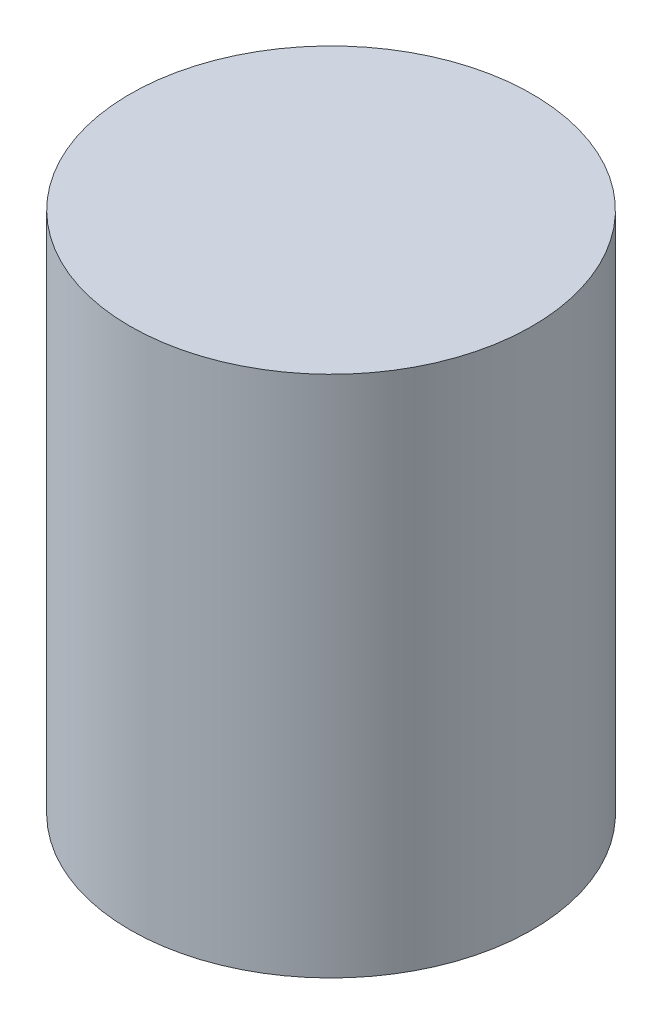
ISO-10303-21;
HEADER;
FILE_DESCRIPTION(('STEP AP214'),'2;1');
FILE_NAME('part.step','',(''),(''),'','','');
FILE_SCHEMA(('AUTOMOTIVE_DESIGN { 1 0 10303 214 1 1 1 1 }'));
ENDSEC;
DATA;
#1=APPLICATION_CONTEXT('core data for automotive mechanical design processes');
#2=APPLICATION_PROTOCOL_DEFINITION('international standard','automotive_design',2000,#1);
#3=PRODUCT_CONTEXT('',#1,'mechanical');
#4=PRODUCT('Part','Part','',(#3));
#5=PRODUCT_RELATED_PRODUCT_CATEGORY('part','',(#4));
#6=PRODUCT_DEFINITION_FORMATION('','',#4);
#7=PRODUCT_DEFINITION_CONTEXT('part definition',#1,'design');
#8=PRODUCT_DEFINITION('design','',#6,#7);
#9=PRODUCT_DEFINITION_SHAPE('','',#8);
#10=(LENGTH_UNIT() NAMED_UNIT(*) SI_UNIT(.MILLI.,.METRE.));
#11=(NAMED_UNIT(*) PLANE_ANGLE_UNIT() SI_UNIT($,.RADIAN.));
#12=(NAMED_UNIT(*) SI_UNIT($,.STERADIAN.) SOLID_ANGLE_UNIT());
#13=UNCERTAINTY_MEASURE_WITH_UNIT(LENGTH_MEASURE(1.E-05),#10,'distance_accuracy_value','');
#14=(GEOMETRIC_REPRESENTATION_CONTEXT(3) GLOBAL_UNCERTAINTY_ASSIGNED_CONTEXT((#13)) GLOBAL_UNIT_ASSIGNED_CONTEXT((#10,
#11,#12)) REPRESENTATION_CONTEXT('',''));
#15=CARTESIAN_POINT('',(0.,0.,0.));
#16=DIRECTION('',(0.,0.,1.));
#17=DIRECTION('',(1.,0.,0.));
#18=AXIS2_PLACEMENT_3D('',#15,#16,#17);
#19=CARTESIAN_POINT('',(-13.6798457858841,-4.09801948210229,47.7982201124123));
#20=DIRECTION('',(0.,1.,0.));
#21=DIRECTION('',(0.,0.,1.));
#22=AXIS2_PLACEMENT_3D('',#19,#20,#21);
#23=CYLINDRICAL_SURFACE('',#22,15.);
#24=CARTESIAN_POINT('',(-13.6798457858841,-4.09801948210229,47.7982201124123));
#25=DIRECTION('',(0.,1.,0.));
#26=DIRECTION('',(0.,0.,1.));
#27=AXIS2_PLACEMENT_3D('',#24,#25,#26);
#28=CIRCLE('',#27,15.);
#29=CARTESIAN_POINT('',(-13.6798457858841,-4.09801948210229,62.7982201124123));
#30=VERTEX_POINT('',#29);
#31=EDGE_CURVE('E10',#30,#30,#28,.T.);
#32=ORIENTED_EDGE('',*,*,#31,.T.);
#33=EDGE_LOOP('',(#32));
#34=FACE_BOUND('',#33,.T.);
#35=CARTESIAN_POINT('',(-13.6798457858841,34.9019805178977,47.7982201124123));
#36=DIRECTION('',(0.,1.,0.));
#37=DIRECTION('',(0.,0.,1.));
#38=AXIS2_PLACEMENT_3D('',#35,#36,#37);
#39=CIRCLE('',#38,15.);
#40=CARTESIAN_POINT('',(-13.6798457858841,34.9019805178977,62.7982201124123));
#41=VERTEX_POINT('',#40);
#42=EDGE_CURVE('E38',#41,#41,#39,.T.);
#43=ORIENTED_EDGE('',*,*,#42,.F.);
#44=EDGE_LOOP('',(#43));
#45=FACE_BOUND('',#44,.T.);
#46=ADVANCED_FACE('F35',(#34,#45),#23,.T.);
#47=CARTESIAN_POINT('',(-13.6798457858841,-4.09801948210229,47.7982201124123));
#48=DIRECTION('',(0.,1.,0.));
#49=DIRECTION('',(0.,0.,1.));
#50=AXIS2_PLACEMENT_3D('',#47,#48,#49);
#51=PLANE('',#50);
#52=ORIENTED_EDGE('',*,*,#31,.F.);
#53=EDGE_LOOP('',(#52));
#54=FACE_BOUND('',#53,.T.);
#55=ADVANCED_FACE('F50',(#54),#51,.F.);
#56=CARTESIAN_POINT('',(-13.6798457858841,34.9019805178977,47.7982201124123));
#57=DIRECTION('',(0.,1.,0.));
#58=DIRECTION('',(0.,0.,1.));
#59=AXIS2_PLACEMENT_3D('',#56,#57,#58);
#60=PLANE('',#59);
#61=ORIENTED_EDGE('',*,*,#42,.T.);
#62=EDGE_LOOP('',(#61));
#63=FACE_BOUND('',#62,.T.);
#64=ADVANCED_FACE('F47',(#63),#60,.T.);
#65=CLOSED_SHELL('',(#46,#55,#64));
#66=MANIFOLD_SOLID_BREP('B2',#65);
#67=ADVANCED_BREP_SHAPE_REPRESENTATION('',(#18,#66),#14);
#68=SHAPE_DEFINITION_REPRESENTATION(#9,#67);
ENDSEC;
END-ISO-10303-21;
